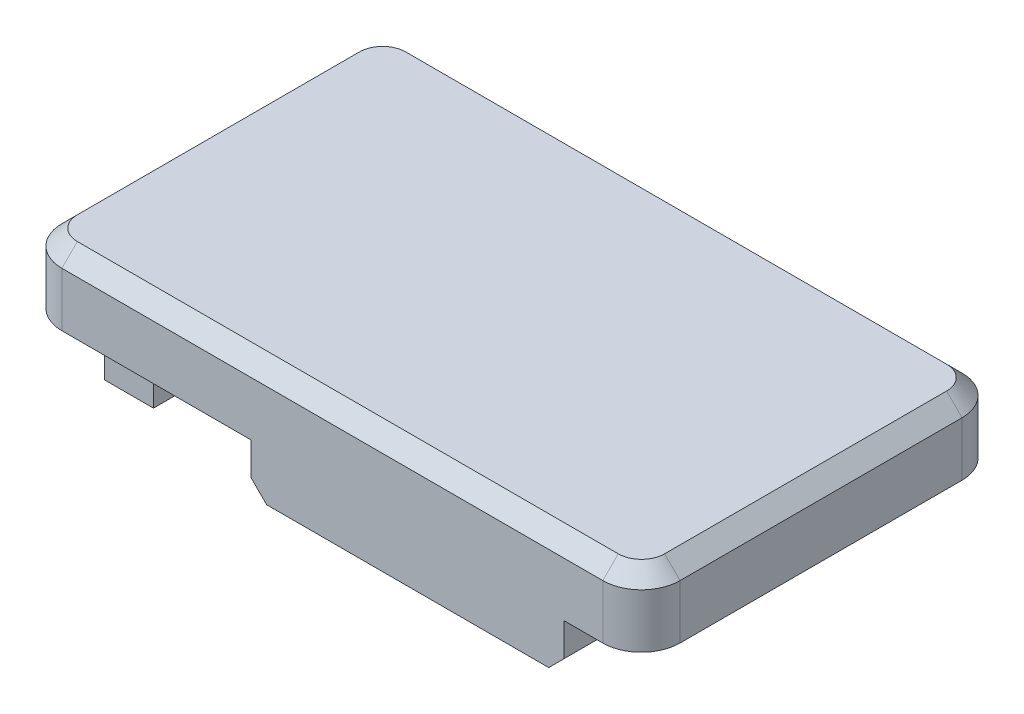
ISO-10303-21;
HEADER;
FILE_DESCRIPTION(('STEP AP214'),'2;1');
FILE_NAME('part.step','',(''),(''),'','','');
FILE_SCHEMA(('AUTOMOTIVE_DESIGN { 1 0 10303 214 1 1 1 1 }'));
ENDSEC;
DATA;
#1=APPLICATION_CONTEXT('core data for automotive mechanical design processes');
#2=APPLICATION_PROTOCOL_DEFINITION('international standard','automotive_design',2000,#1);
#3=PRODUCT_CONTEXT('',#1,'mechanical');
#4=PRODUCT('Part','Part','',(#3));
#5=PRODUCT_RELATED_PRODUCT_CATEGORY('part','',(#4));
#6=PRODUCT_DEFINITION_FORMATION('','',#4);
#7=PRODUCT_DEFINITION_CONTEXT('part definition',#1,'design');
#8=PRODUCT_DEFINITION('design','',#6,#7);
#9=PRODUCT_DEFINITION_SHAPE('','',#8);
#10=(LENGTH_UNIT() NAMED_UNIT(*) SI_UNIT(.MILLI.,.METRE.));
#11=(NAMED_UNIT(*) PLANE_ANGLE_UNIT() SI_UNIT($,.RADIAN.));
#12=(NAMED_UNIT(*) SI_UNIT($,.STERADIAN.) SOLID_ANGLE_UNIT());
#13=UNCERTAINTY_MEASURE_WITH_UNIT(LENGTH_MEASURE(1.E-05),#10,'distance_accuracy_value','');
#14=(GEOMETRIC_REPRESENTATION_CONTEXT(3) GLOBAL_UNCERTAINTY_ASSIGNED_CONTEXT((#13)) GLOBAL_UNIT_ASSIGNED_CONTEXT((#10,
#11,#12)) REPRESENTATION_CONTEXT('',''));
#15=CARTESIAN_POINT('',(0.,0.,0.));
#16=DIRECTION('',(0.,0.,1.));
#17=DIRECTION('',(1.,0.,0.));
#18=AXIS2_PLACEMENT_3D('',#15,#16,#17);
#19=CARTESIAN_POINT('',(0.,0.,0.));
#20=DIRECTION('',(0.,1.,0.));
#21=DIRECTION('',(0.,0.,1.));
#22=AXIS2_PLACEMENT_3D('',#19,#20,#21);
#23=PLANE('',#22);
#24=DIRECTION('',(-1.,0.,0.));
#25=VECTOR('',#24,1.);
#26=CARTESIAN_POINT('',(66.8395192480296,0.,-2.2));
#27=LINE('',#26,#25);
#28=CARTESIAN_POINT('',(66.8395192480296,0.,-2.2));
#29=VERTEX_POINT('',#28);
#30=CARTESIAN_POINT('',(64.2995192480296,0.,-2.2));
#31=VERTEX_POINT('',#30);
#32=EDGE_CURVE('E252',#29,#31,#27,.T.);
#33=ORIENTED_EDGE('',*,*,#32,.F.);
#34=DIRECTION('',(0.,0.,1.));
#35=VECTOR('',#34,1.);
#36=CARTESIAN_POINT('',(66.8395192480296,0.,-12.36));
#37=LINE('',#36,#35);
#38=CARTESIAN_POINT('',(66.8395192480296,0.,-12.36));
#39=VERTEX_POINT('',#38);
#40=EDGE_CURVE('E317',#39,#29,#37,.T.);
#41=ORIENTED_EDGE('',*,*,#40,.F.);
#42=DIRECTION('',(1.,0.,0.));
#43=VECTOR('',#42,1.);
#44=CARTESIAN_POINT('',(64.2995192480296,0.,-12.36));
#45=LINE('',#44,#43);
#46=CARTESIAN_POINT('',(64.2995192480296,0.,-12.36));
#47=VERTEX_POINT('',#46);
#48=EDGE_CURVE('E334',#47,#39,#45,.T.);
#49=ORIENTED_EDGE('',*,*,#48,.F.);
#50=DIRECTION('',(0.,0.,-1.));
#51=VECTOR('',#50,1.);
#52=CARTESIAN_POINT('',(64.2995192480296,0.,-2.2));
#53=LINE('',#52,#51);
#54=EDGE_CURVE('E330',#31,#47,#53,.T.);
#55=ORIENTED_EDGE('',*,*,#54,.F.);
#56=EDGE_LOOP('',(#33,#41,#49,#55));
#57=FACE_BOUND('',#56,.T.);
#58=DIRECTION('',(0.,0.,1.));
#59=VECTOR('',#58,1.);
#60=CARTESIAN_POINT('',(62.2995192480296,0.,-18.6));
#61=LINE('',#60,#59);
#62=CARTESIAN_POINT('',(62.2995192480296,0.,-16.6));
#63=VERTEX_POINT('',#62);
#64=CARTESIAN_POINT('',(62.2995192480296,0.,-2.));
#65=VERTEX_POINT('',#64);
#66=EDGE_CURVE('E356',#63,#65,#61,.T.);
#67=ORIENTED_EDGE('',*,*,#66,.F.);
#68=CARTESIAN_POINT('',(64.2995192480296,0.,-16.6));
#69=DIRECTION('',(0.,1.,0.));
#70=DIRECTION('',(0.,0.,1.));
#71=AXIS2_PLACEMENT_3D('',#68,#69,#70);
#72=CIRCLE('',#71,2.);
#73=CARTESIAN_POINT('',(64.2995192480296,0.,-18.6));
#74=VERTEX_POINT('',#73);
#75=EDGE_CURVE('E389',#63,#74,#72,.F.);
#76=ORIENTED_EDGE('',*,*,#75,.T.);
#77=DIRECTION('',(-1.,0.,0.));
#78=VECTOR('',#77,1.);
#79=CARTESIAN_POINT('',(94.2995192480296,0.,-18.6));
#80=LINE('',#79,#78);
#81=CARTESIAN_POINT('',(74.0995192480296,0.,-18.6));
#82=VERTEX_POINT('',#81);
#83=EDGE_CURVE('E369',#82,#74,#80,.T.);
#84=ORIENTED_EDGE('',*,*,#83,.F.);
#85=DIRECTION('',(0.,0.,-1.));
#86=VECTOR('',#85,1.);
#87=CARTESIAN_POINT('',(74.0995192480296,0.,-18.6));
#88=LINE('',#87,#86);
#89=CARTESIAN_POINT('',(74.0995192480296,0.,-16.6));
#90=VERTEX_POINT('',#89);
#91=EDGE_CURVE('E269',#90,#82,#88,.T.);
#92=ORIENTED_EDGE('',*,*,#91,.F.);
#93=DIRECTION('',(-1.,0.,0.));
#94=VECTOR('',#93,1.);
#95=CARTESIAN_POINT('',(74.0995192480296,0.,-16.6));
#96=LINE('',#95,#94);
#97=CARTESIAN_POINT('',(90.2995192480296,0.,-16.6));
#98=VERTEX_POINT('',#97);
#99=EDGE_CURVE('E245',#98,#90,#96,.T.);
#100=ORIENTED_EDGE('',*,*,#99,.F.);
#101=DIRECTION('',(0.,0.,1.));
#102=VECTOR('',#101,1.);
#103=CARTESIAN_POINT('',(90.2995192480296,0.,-16.6));
#104=LINE('',#103,#102);
#105=CARTESIAN_POINT('',(90.2995192480296,0.,-18.6));
#106=VERTEX_POINT('',#105);
#107=EDGE_CURVE('E256',#106,#98,#104,.T.);
#108=ORIENTED_EDGE('',*,*,#107,.F.);
#109=CARTESIAN_POINT('',(92.2995192480296,0.,-18.6));
#110=VERTEX_POINT('',#109);
#111=EDGE_CURVE('E370',#110,#106,#80,.T.);
#112=ORIENTED_EDGE('',*,*,#111,.F.);
#113=CARTESIAN_POINT('',(92.2995192480296,0.,-16.6));
#114=DIRECTION('',(0.,1.,0.));
#115=DIRECTION('',(0.,0.,1.));
#116=AXIS2_PLACEMENT_3D('',#113,#114,#115);
#117=CIRCLE('',#116,2.);
#118=CARTESIAN_POINT('',(94.2995192480296,0.,-16.6));
#119=VERTEX_POINT('',#118);
#120=EDGE_CURVE('E386',#110,#119,#117,.F.);
#121=ORIENTED_EDGE('',*,*,#120,.T.);
#122=DIRECTION('',(0.,0.,-1.));
#123=VECTOR('',#122,1.);
#124=CARTESIAN_POINT('',(94.2995192480296,0.,0.));
#125=LINE('',#124,#123);
#126=CARTESIAN_POINT('',(94.2995192480296,0.,-2.));
#127=VERTEX_POINT('',#126);
#128=EDGE_CURVE('E365',#127,#119,#125,.T.);
#129=ORIENTED_EDGE('',*,*,#128,.F.);
#130=CARTESIAN_POINT('',(92.2995192480296,0.,-2.));
#131=DIRECTION('',(0.,1.,0.));
#132=DIRECTION('',(0.,0.,1.));
#133=AXIS2_PLACEMENT_3D('',#130,#131,#132);
#134=CIRCLE('',#133,2.);
#135=CARTESIAN_POINT('',(92.2995192480296,0.,0.));
#136=VERTEX_POINT('',#135);
#137=EDGE_CURVE('E383',#127,#136,#134,.F.);
#138=ORIENTED_EDGE('',*,*,#137,.T.);
#139=DIRECTION('',(1.,0.,0.));
#140=VECTOR('',#139,1.);
#141=CARTESIAN_POINT('',(62.2995192480296,0.,0.));
#142=LINE('',#141,#140);
#143=CARTESIAN_POINT('',(90.2995192480296,0.,0.));
#144=VERTEX_POINT('',#143);
#145=EDGE_CURVE('E360',#144,#136,#142,.T.);
#146=ORIENTED_EDGE('',*,*,#145,.F.);
#147=DIRECTION('',(0.,0.,1.));
#148=VECTOR('',#147,1.);
#149=CARTESIAN_POINT('',(90.2995192480296,0.,-2.));
#150=LINE('',#149,#148);
#151=CARTESIAN_POINT('',(90.2995192480296,0.,-2.));
#152=VERTEX_POINT('',#151);
#153=EDGE_CURVE('E302',#152,#144,#150,.T.);
#154=ORIENTED_EDGE('',*,*,#153,.F.);
#155=DIRECTION('',(1.,0.,0.));
#156=VECTOR('',#155,1.);
#157=CARTESIAN_POINT('',(74.0995192480296,0.,-2.));
#158=LINE('',#157,#156);
#159=CARTESIAN_POINT('',(74.0995192480296,0.,-2.));
#160=VERTEX_POINT('',#159);
#161=EDGE_CURVE('E264',#160,#152,#158,.T.);
#162=ORIENTED_EDGE('',*,*,#161,.F.);
#163=DIRECTION('',(0.,0.,-1.));
#164=VECTOR('',#163,1.);
#165=CARTESIAN_POINT('',(74.0995192480296,0.,0.));
#166=LINE('',#165,#164);
#167=CARTESIAN_POINT('',(74.0995192480296,0.,0.));
#168=VERTEX_POINT('',#167);
#169=EDGE_CURVE('E298',#168,#160,#166,.T.);
#170=ORIENTED_EDGE('',*,*,#169,.F.);
#171=CARTESIAN_POINT('',(64.2995192480296,0.,0.));
#172=VERTEX_POINT('',#171);
#173=EDGE_CURVE('E361',#172,#168,#142,.T.);
#174=ORIENTED_EDGE('',*,*,#173,.F.);
#175=CARTESIAN_POINT('',(64.2995192480296,0.,-2.));
#176=DIRECTION('',(0.,1.,0.));
#177=DIRECTION('',(0.,0.,1.));
#178=AXIS2_PLACEMENT_3D('',#175,#176,#177);
#179=CIRCLE('',#178,2.);
#180=EDGE_CURVE('E380',#172,#65,#179,.F.);
#181=ORIENTED_EDGE('',*,*,#180,.T.);
#182=EDGE_LOOP('',(#67,#76,#84,#92,#100,#108,#112,#121,#129,#138,#146,#154,#162,#170,#174,#181));
#183=FACE_BOUND('',#182,.T.);
#184=ADVANCED_FACE('F52',(#57,#183),#23,.F.);
#185=CARTESIAN_POINT('',(62.2995192480296,3.6,-18.6));
#186=DIRECTION('',(1.,0.,0.));
#187=DIRECTION('',(0.,0.,-1.));
#188=AXIS2_PLACEMENT_3D('',#185,#186,#187);
#189=PLANE('',#188);
#190=DIRECTION('',(0.,-1.,0.));
#191=VECTOR('',#190,1.);
#192=CARTESIAN_POINT('',(62.2995192480296,3.6,-2.));
#193=LINE('',#192,#191);
#194=CARTESIAN_POINT('',(62.2995192480296,2.8,-2.));
#195=VERTEX_POINT('',#194);
#196=EDGE_CURVE('E373',#65,#195,#193,.F.);
#197=ORIENTED_EDGE('',*,*,#196,.T.);
#198=DIRECTION('',(0.,0.,-1.));
#199=VECTOR('',#198,1.);
#200=CARTESIAN_POINT('',(62.2995192480296,2.8,-16.6));
#201=LINE('',#200,#199);
#202=CARTESIAN_POINT('',(62.2995192480296,2.8,-16.6));
#203=VERTEX_POINT('',#202);
#204=EDGE_CURVE('E454',#195,#203,#201,.T.);
#205=ORIENTED_EDGE('',*,*,#204,.T.);
#206=DIRECTION('',(0.,-1.,0.));
#207=VECTOR('',#206,1.);
#208=CARTESIAN_POINT('',(62.2995192480296,3.6,-16.6));
#209=LINE('',#208,#207);
#210=EDGE_CURVE('E377',#203,#63,#209,.T.);
#211=ORIENTED_EDGE('',*,*,#210,.T.);
#212=ORIENTED_EDGE('',*,*,#66,.T.);
#213=EDGE_LOOP('',(#197,#205,#211,#212));
#214=FACE_BOUND('',#213,.T.);
#215=ADVANCED_FACE('F666',(#214),#189,.F.);
#216=CARTESIAN_POINT('',(62.2995192480296,3.6,0.));
#217=DIRECTION('',(0.,0.,-1.));
#218=DIRECTION('',(-1.,0.,0.));
#219=AXIS2_PLACEMENT_3D('',#216,#217,#218);
#220=PLANE('',#219);
#221=DIRECTION('',(0.,1.,0.));
#222=VECTOR('',#221,1.);
#223=CARTESIAN_POINT('',(74.0995192480296,-2.5,0.));
#224=LINE('',#223,#222);
#225=CARTESIAN_POINT('',(74.0995192480296,-1.69999999999999,0.));
#226=VERTEX_POINT('',#225);
#227=EDGE_CURVE('E291',#226,#168,#224,.T.);
#228=ORIENTED_EDGE('',*,*,#227,.F.);
#229=DIRECTION('',(0.707106781186548,-0.707106781186548,0.));
#230=VECTOR('',#229,1.);
#231=CARTESIAN_POINT('',(74.8995192480296,-2.5,0.));
#232=LINE('',#231,#230);
#233=CARTESIAN_POINT('',(74.8995192480296,-2.5,0.));
#234=VERTEX_POINT('',#233);
#235=EDGE_CURVE('E532',#226,#234,#232,.T.);
#236=ORIENTED_EDGE('',*,*,#235,.T.);
#237=DIRECTION('',(-1.,0.,0.));
#238=VECTOR('',#237,1.);
#239=CARTESIAN_POINT('',(90.2995192480296,-2.5,0.));
#240=LINE('',#239,#238);
#241=CARTESIAN_POINT('',(89.4995192480296,-2.5,0.));
#242=VERTEX_POINT('',#241);
#243=EDGE_CURVE('E297',#242,#234,#240,.T.);
#244=ORIENTED_EDGE('',*,*,#243,.F.);
#245=DIRECTION('',(0.707106781186548,0.707106781186548,0.));
#246=VECTOR('',#245,1.);
#247=CARTESIAN_POINT('',(89.4995192480296,-2.5,0.));
#248=LINE('',#247,#246);
#249=CARTESIAN_POINT('',(90.2995192480296,-1.69999999999999,0.));
#250=VERTEX_POINT('',#249);
#251=EDGE_CURVE('E78',#242,#250,#248,.T.);
#252=ORIENTED_EDGE('',*,*,#251,.T.);
#253=DIRECTION('',(0.,1.,0.));
#254=VECTOR('',#253,1.);
#255=CARTESIAN_POINT('',(90.2995192480296,-2.5,0.));
#256=LINE('',#255,#254);
#257=EDGE_CURVE('E287',#250,#144,#256,.T.);
#258=ORIENTED_EDGE('',*,*,#257,.T.);
#259=ORIENTED_EDGE('',*,*,#145,.T.);
#260=DIRECTION('',(0.,-1.,0.));
#261=VECTOR('',#260,1.);
#262=CARTESIAN_POINT('',(92.2995192480296,3.6,0.));
#263=LINE('',#262,#261);
#264=CARTESIAN_POINT('',(92.2995192480296,2.8,0.));
#265=VERTEX_POINT('',#264);
#266=EDGE_CURVE('E409',#136,#265,#263,.F.);
#267=ORIENTED_EDGE('',*,*,#266,.T.);
#268=DIRECTION('',(-1.,0.,0.));
#269=VECTOR('',#268,1.);
#270=CARTESIAN_POINT('',(64.2995192480296,2.8,0.));
#271=LINE('',#270,#269);
#272=CARTESIAN_POINT('',(64.2995192480296,2.8,0.));
#273=VERTEX_POINT('',#272);
#274=EDGE_CURVE('E448',#265,#273,#271,.T.);
#275=ORIENTED_EDGE('',*,*,#274,.T.);
#276=DIRECTION('',(0.,-1.,0.));
#277=VECTOR('',#276,1.);
#278=CARTESIAN_POINT('',(64.2995192480296,3.6,0.));
#279=LINE('',#278,#277);
#280=EDGE_CURVE('E406',#273,#172,#279,.T.);
#281=ORIENTED_EDGE('',*,*,#280,.T.);
#282=ORIENTED_EDGE('',*,*,#173,.T.);
#283=EDGE_LOOP('',(#228,#236,#244,#252,#258,#259,#267,#275,#281,#282));
#284=FACE_BOUND('',#283,.T.);
#285=ADVANCED_FACE('F561',(#284),#220,.F.);
#286=CARTESIAN_POINT('',(94.2995192480296,3.6,0.));
#287=DIRECTION('',(-1.,0.,0.));
#288=DIRECTION('',(0.,0.,1.));
#289=AXIS2_PLACEMENT_3D('',#286,#287,#288);
#290=PLANE('',#289);
#291=DIRECTION('',(0.,-1.,0.));
#292=VECTOR('',#291,1.);
#293=CARTESIAN_POINT('',(94.2995192480296,3.6,-16.6));
#294=LINE('',#293,#292);
#295=CARTESIAN_POINT('',(94.2995192480296,2.8,-16.6));
#296=VERTEX_POINT('',#295);
#297=EDGE_CURVE('E402',#119,#296,#294,.F.);
#298=ORIENTED_EDGE('',*,*,#297,.T.);
#299=DIRECTION('',(0.,0.,1.));
#300=VECTOR('',#299,1.);
#301=CARTESIAN_POINT('',(94.2995192480296,2.8,-2.));
#302=LINE('',#301,#300);
#303=CARTESIAN_POINT('',(94.2995192480296,2.8,-2.));
#304=VERTEX_POINT('',#303);
#305=EDGE_CURVE('E442',#296,#304,#302,.T.);
#306=ORIENTED_EDGE('',*,*,#305,.T.);
#307=DIRECTION('',(0.,-1.,0.));
#308=VECTOR('',#307,1.);
#309=CARTESIAN_POINT('',(94.2995192480296,3.6,-2.));
#310=LINE('',#309,#308);
#311=EDGE_CURVE('E399',#304,#127,#310,.T.);
#312=ORIENTED_EDGE('',*,*,#311,.T.);
#313=ORIENTED_EDGE('',*,*,#128,.T.);
#314=EDGE_LOOP('',(#298,#306,#312,#313));
#315=FACE_BOUND('',#314,.T.);
#316=ADVANCED_FACE('F637',(#315),#290,.F.);
#317=CARTESIAN_POINT('',(94.2995192480296,3.6,-18.6));
#318=DIRECTION('',(0.,0.,1.));
#319=DIRECTION('',(1.,0.,0.));
#320=AXIS2_PLACEMENT_3D('',#317,#318,#319);
#321=PLANE('',#320);
#322=DIRECTION('',(1.,0.,0.));
#323=VECTOR('',#322,1.);
#324=CARTESIAN_POINT('',(90.2995192480296,-2.5,-18.6));
#325=LINE('',#324,#323);
#326=CARTESIAN_POINT('',(74.8995192480296,-2.5,-18.6));
#327=VERTEX_POINT('',#326);
#328=CARTESIAN_POINT('',(89.4995192480296,-2.5,-18.6));
#329=VERTEX_POINT('',#328);
#330=EDGE_CURVE('E273',#327,#329,#325,.T.);
#331=ORIENTED_EDGE('',*,*,#330,.F.);
#332=DIRECTION('',(0.707106781186544,-0.707106781186551,0.));
#333=VECTOR('',#332,1.);
#334=CARTESIAN_POINT('',(74.8995192480296,-2.5,-18.6));
#335=LINE('',#334,#333);
#336=CARTESIAN_POINT('',(74.0995192480296,-1.7,-18.6));
#337=VERTEX_POINT('',#336);
#338=EDGE_CURVE('E506',#327,#337,#335,.F.);
#339=ORIENTED_EDGE('',*,*,#338,.T.);
#340=DIRECTION('',(0.,1.,0.));
#341=VECTOR('',#340,1.);
#342=CARTESIAN_POINT('',(74.0995192480296,-2.5,-18.6));
#343=LINE('',#342,#341);
#344=EDGE_CURVE('E279',#337,#82,#343,.T.);
#345=ORIENTED_EDGE('',*,*,#344,.T.);
#346=ORIENTED_EDGE('',*,*,#83,.T.);
#347=DIRECTION('',(0.,-1.,0.));
#348=VECTOR('',#347,1.);
#349=CARTESIAN_POINT('',(64.2995192480296,3.6,-18.6));
#350=LINE('',#349,#348);
#351=CARTESIAN_POINT('',(64.2995192480296,2.8,-18.6));
#352=VERTEX_POINT('',#351);
#353=EDGE_CURVE('E395',#74,#352,#350,.F.);
#354=ORIENTED_EDGE('',*,*,#353,.T.);
#355=DIRECTION('',(1.,0.,0.));
#356=VECTOR('',#355,1.);
#357=CARTESIAN_POINT('',(92.2995192480296,2.8,-18.6));
#358=LINE('',#357,#356);
#359=CARTESIAN_POINT('',(92.2995192480296,2.8,-18.6));
#360=VERTEX_POINT('',#359);
#361=EDGE_CURVE('E460',#352,#360,#358,.T.);
#362=ORIENTED_EDGE('',*,*,#361,.T.);
#363=DIRECTION('',(0.,-1.,0.));
#364=VECTOR('',#363,1.);
#365=CARTESIAN_POINT('',(92.2995192480296,3.6,-18.6));
#366=LINE('',#365,#364);
#367=EDGE_CURVE('E392',#360,#110,#366,.T.);
#368=ORIENTED_EDGE('',*,*,#367,.T.);
#369=ORIENTED_EDGE('',*,*,#111,.T.);
#370=DIRECTION('',(0.,1.,0.));
#371=VECTOR('',#370,1.);
#372=CARTESIAN_POINT('',(90.2995192480296,-2.5,-18.6));
#373=LINE('',#372,#371);
#374=CARTESIAN_POINT('',(90.2995192480296,-1.7,-18.6));
#375=VERTEX_POINT('',#374);
#376=EDGE_CURVE('E259',#375,#106,#373,.T.);
#377=ORIENTED_EDGE('',*,*,#376,.F.);
#378=DIRECTION('',(0.707106781186544,0.707106781186551,0.));
#379=VECTOR('',#378,1.);
#380=CARTESIAN_POINT('',(89.4995192480296,-2.5,-18.6));
#381=LINE('',#380,#379);
#382=EDGE_CURVE('E503',#375,#329,#381,.F.);
#383=ORIENTED_EDGE('',*,*,#382,.T.);
#384=EDGE_LOOP('',(#331,#339,#345,#346,#354,#362,#368,#369,#377,#383));
#385=FACE_BOUND('',#384,.T.);
#386=ADVANCED_FACE('F599',(#385),#321,.F.);
#387=CARTESIAN_POINT('',(0.,3.6,0.));
#388=DIRECTION('',(0.,1.,0.));
#389=DIRECTION('',(0.,0.,1.));
#390=AXIS2_PLACEMENT_3D('',#387,#388,#389);
#391=PLANE('',#390);
#392=DIRECTION('',(0.,0.,-1.));
#393=VECTOR('',#392,1.);
#394=CARTESIAN_POINT('',(93.4995192480296,3.6,-16.6));
#395=LINE('',#394,#393);
#396=CARTESIAN_POINT('',(93.4995192480296,3.6,-2.));
#397=VERTEX_POINT('',#396);
#398=CARTESIAN_POINT('',(93.4995192480296,3.6,-16.6));
#399=VERTEX_POINT('',#398);
#400=EDGE_CURVE('E431',#397,#399,#395,.T.);
#401=ORIENTED_EDGE('',*,*,#400,.T.);
#402=CARTESIAN_POINT('',(92.2995192480296,3.6,-16.6));
#403=DIRECTION('',(0.,1.,0.));
#404=DIRECTION('',(0.,0.,1.));
#405=AXIS2_PLACEMENT_3D('',#402,#403,#404);
#406=CIRCLE('',#405,1.20000000000001);
#407=CARTESIAN_POINT('',(92.2995192480296,3.6,-17.8));
#408=VERTEX_POINT('',#407);
#409=EDGE_CURVE('E434',#399,#408,#406,.T.);
#410=ORIENTED_EDGE('',*,*,#409,.T.);
#411=DIRECTION('',(-1.,0.,0.));
#412=VECTOR('',#411,1.);
#413=CARTESIAN_POINT('',(64.2995192480296,3.6,-17.8));
#414=LINE('',#413,#412);
#415=CARTESIAN_POINT('',(64.2995192480296,3.6,-17.8));
#416=VERTEX_POINT('',#415);
#417=EDGE_CURVE('E413',#408,#416,#414,.T.);
#418=ORIENTED_EDGE('',*,*,#417,.T.);
#419=CARTESIAN_POINT('',(64.2995192480296,3.6,-16.6));
#420=DIRECTION('',(0.,1.,0.));
#421=DIRECTION('',(0.,0.,1.));
#422=AXIS2_PLACEMENT_3D('',#419,#420,#421);
#423=CIRCLE('',#422,1.20000000000001);
#424=CARTESIAN_POINT('',(63.0995192480296,3.6,-16.6));
#425=VERTEX_POINT('',#424);
#426=EDGE_CURVE('E416',#416,#425,#423,.T.);
#427=ORIENTED_EDGE('',*,*,#426,.T.);
#428=DIRECTION('',(0.,0.,1.));
#429=VECTOR('',#428,1.);
#430=CARTESIAN_POINT('',(63.0995192480296,3.6,-2.));
#431=LINE('',#430,#429);
#432=CARTESIAN_POINT('',(63.0995192480296,3.6,-2.));
#433=VERTEX_POINT('',#432);
#434=EDGE_CURVE('E419',#425,#433,#431,.T.);
#435=ORIENTED_EDGE('',*,*,#434,.T.);
#436=CARTESIAN_POINT('',(64.2995192480296,3.6,-2.));
#437=DIRECTION('',(0.,1.,0.));
#438=DIRECTION('',(0.,0.,1.));
#439=AXIS2_PLACEMENT_3D('',#436,#437,#438);
#440=CIRCLE('',#439,1.20000000000001);
#441=CARTESIAN_POINT('',(64.2995192480296,3.6,-0.799999999999993));
#442=VERTEX_POINT('',#441);
#443=EDGE_CURVE('E422',#433,#442,#440,.T.);
#444=ORIENTED_EDGE('',*,*,#443,.T.);
#445=DIRECTION('',(1.,0.,0.));
#446=VECTOR('',#445,1.);
#447=CARTESIAN_POINT('',(92.2995192480296,3.6,-0.799999999999995));
#448=LINE('',#447,#446);
#449=CARTESIAN_POINT('',(92.2995192480296,3.6,-0.799999999999995));
#450=VERTEX_POINT('',#449);
#451=EDGE_CURVE('E425',#442,#450,#448,.T.);
#452=ORIENTED_EDGE('',*,*,#451,.T.);
#453=CARTESIAN_POINT('',(92.2995192480296,3.6,-2.));
#454=DIRECTION('',(0.,1.,0.));
#455=DIRECTION('',(0.,0.,1.));
#456=AXIS2_PLACEMENT_3D('',#453,#454,#455);
#457=CIRCLE('',#456,1.20000000000001);
#458=EDGE_CURVE('E428',#450,#397,#457,.T.);
#459=ORIENTED_EDGE('',*,*,#458,.T.);
#460=EDGE_LOOP('',(#401,#410,#418,#427,#435,#444,#452,#459));
#461=FACE_BOUND('',#460,.T.);
#462=ADVANCED_FACE('F836',(#461),#391,.T.);
#463=CARTESIAN_POINT('',(66.8395192480296,-3.3,-2.2));
#464=DIRECTION('',(0.,0.,-1.));
#465=DIRECTION('',(-1.,0.,0.));
#466=AXIS2_PLACEMENT_3D('',#463,#464,#465);
#467=PLANE('',#466);
#468=ORIENTED_EDGE('',*,*,#32,.T.);
#469=DIRECTION('',(0.,1.,0.));
#470=VECTOR('',#469,1.);
#471=CARTESIAN_POINT('',(64.2995192480296,-3.3,-2.2));
#472=LINE('',#471,#470);
#473=CARTESIAN_POINT('',(64.2995192480296,-3.3,-2.2));
#474=VERTEX_POINT('',#473);
#475=EDGE_CURVE('E352',#474,#31,#472,.T.);
#476=ORIENTED_EDGE('',*,*,#475,.F.);
#477=DIRECTION('',(-1.,0.,0.));
#478=VECTOR('',#477,1.);
#479=CARTESIAN_POINT('',(66.8395192480296,-3.3,-2.2));
#480=LINE('',#479,#478);
#481=CARTESIAN_POINT('',(66.8395192480296,-3.3,-2.2));
#482=VERTEX_POINT('',#481);
#483=EDGE_CURVE('E312',#482,#474,#480,.T.);
#484=ORIENTED_EDGE('',*,*,#483,.F.);
#485=DIRECTION('',(0.,1.,0.));
#486=VECTOR('',#485,1.);
#487=CARTESIAN_POINT('',(66.8395192480296,-3.3,-2.2));
#488=LINE('',#487,#486);
#489=EDGE_CURVE('E326',#482,#29,#488,.T.);
#490=ORIENTED_EDGE('',*,*,#489,.T.);
#491=EDGE_LOOP('',(#468,#476,#484,#490));
#492=FACE_BOUND('',#491,.T.);
#493=ADVANCED_FACE('F909',(#492),#467,.F.);
#494=CARTESIAN_POINT('',(64.2995192480296,-3.3,-2.2));
#495=DIRECTION('',(1.,0.,0.));
#496=DIRECTION('',(0.,0.,-1.));
#497=AXIS2_PLACEMENT_3D('',#494,#495,#496);
#498=PLANE('',#497);
#499=ORIENTED_EDGE('',*,*,#54,.T.);
#500=DIRECTION('',(0.,1.,0.));
#501=VECTOR('',#500,1.);
#502=CARTESIAN_POINT('',(64.2995192480296,-3.3,-12.36));
#503=LINE('',#502,#501);
#504=CARTESIAN_POINT('',(64.2995192480296,-3.3,-12.36));
#505=VERTEX_POINT('',#504);
#506=EDGE_CURVE('E348',#505,#47,#503,.T.);
#507=ORIENTED_EDGE('',*,*,#506,.F.);
#508=DIRECTION('',(0.,0.,-1.));
#509=VECTOR('',#508,1.);
#510=CARTESIAN_POINT('',(64.2995192480296,-3.3,-2.2));
#511=LINE('',#510,#509);
#512=EDGE_CURVE('E316',#474,#505,#511,.T.);
#513=ORIENTED_EDGE('',*,*,#512,.F.);
#514=ORIENTED_EDGE('',*,*,#475,.T.);
#515=EDGE_LOOP('',(#499,#507,#513,#514));
#516=FACE_BOUND('',#515,.T.);
#517=ADVANCED_FACE('F936',(#516),#498,.F.);
#518=CARTESIAN_POINT('',(64.2995192480296,-3.3,-12.36));
#519=DIRECTION('',(0.,0.,1.));
#520=DIRECTION('',(1.,0.,0.));
#521=AXIS2_PLACEMENT_3D('',#518,#519,#520);
#522=PLANE('',#521);
#523=ORIENTED_EDGE('',*,*,#48,.T.);
#524=DIRECTION('',(0.,1.,0.));
#525=VECTOR('',#524,1.);
#526=CARTESIAN_POINT('',(66.8395192480296,-3.3,-12.36));
#527=LINE('',#526,#525);
#528=CARTESIAN_POINT('',(66.8395192480296,-3.3,-12.36));
#529=VERTEX_POINT('',#528);
#530=EDGE_CURVE('E344',#529,#39,#527,.T.);
#531=ORIENTED_EDGE('',*,*,#530,.F.);
#532=DIRECTION('',(1.,0.,0.));
#533=VECTOR('',#532,1.);
#534=CARTESIAN_POINT('',(64.2995192480296,-3.3,-12.36));
#535=LINE('',#534,#533);
#536=EDGE_CURVE('E320',#505,#529,#535,.T.);
#537=ORIENTED_EDGE('',*,*,#536,.F.);
#538=ORIENTED_EDGE('',*,*,#506,.T.);
#539=EDGE_LOOP('',(#523,#531,#537,#538));
#540=FACE_BOUND('',#539,.T.);
#541=ADVANCED_FACE('F946',(#540),#522,.F.);
#542=CARTESIAN_POINT('',(66.8395192480296,-3.3,-12.36));
#543=DIRECTION('',(-1.,0.,0.));
#544=DIRECTION('',(0.,0.,1.));
#545=AXIS2_PLACEMENT_3D('',#542,#543,#544);
#546=PLANE('',#545);
#547=ORIENTED_EDGE('',*,*,#40,.T.);
#548=ORIENTED_EDGE('',*,*,#489,.F.);
#549=DIRECTION('',(0.,0.,1.));
#550=VECTOR('',#549,1.);
#551=CARTESIAN_POINT('',(66.8395192480296,-3.3,-12.36));
#552=LINE('',#551,#550);
#553=EDGE_CURVE('E323',#529,#482,#552,.T.);
#554=ORIENTED_EDGE('',*,*,#553,.F.);
#555=ORIENTED_EDGE('',*,*,#530,.T.);
#556=EDGE_LOOP('',(#547,#548,#554,#555));
#557=FACE_BOUND('',#556,.T.);
#558=ADVANCED_FACE('F956',(#557),#546,.F.);
#559=CARTESIAN_POINT('',(0.,-3.3,0.));
#560=DIRECTION('',(0.,-1.,0.));
#561=DIRECTION('',(0.,0.,-1.));
#562=AXIS2_PLACEMENT_3D('',#559,#560,#561);
#563=PLANE('',#562);
#564=ORIENTED_EDGE('',*,*,#483,.T.);
#565=ORIENTED_EDGE('',*,*,#512,.T.);
#566=ORIENTED_EDGE('',*,*,#536,.T.);
#567=ORIENTED_EDGE('',*,*,#553,.T.);
#568=EDGE_LOOP('',(#564,#565,#566,#567));
#569=FACE_BOUND('',#568,.T.);
#570=ADVANCED_FACE('F829',(#569),#563,.T.);
#571=CARTESIAN_POINT('',(90.2995192480296,-2.5,-16.6));
#572=DIRECTION('',(-1.,0.,0.));
#573=DIRECTION('',(0.,0.,1.));
#574=AXIS2_PLACEMENT_3D('',#571,#572,#573);
#575=PLANE('',#574);
#576=DIRECTION('',(0.,1.,0.));
#577=VECTOR('',#576,1.);
#578=CARTESIAN_POINT('',(90.2995192480296,-2.5,-16.6));
#579=LINE('',#578,#577);
#580=CARTESIAN_POINT('',(90.2995192480296,-1.7,-16.6));
#581=VERTEX_POINT('',#580);
#582=EDGE_CURVE('E240',#581,#98,#579,.T.);
#583=ORIENTED_EDGE('',*,*,#582,.F.);
#584=DIRECTION('',(0.,0.,-1.));
#585=VECTOR('',#584,1.);
#586=CARTESIAN_POINT('',(90.2995192480296,-1.7,-16.6));
#587=LINE('',#586,#585);
#588=EDGE_CURVE('E512',#581,#375,#587,.T.);
#589=ORIENTED_EDGE('',*,*,#588,.T.);
#590=ORIENTED_EDGE('',*,*,#376,.T.);
#591=ORIENTED_EDGE('',*,*,#107,.T.);
#592=EDGE_LOOP('',(#583,#589,#590,#591));
#593=FACE_BOUND('',#592,.T.);
#594=ADVANCED_FACE('F257',(#593),#575,.F.);
#595=CARTESIAN_POINT('',(74.0995192480296,-2.5,-16.6));
#596=DIRECTION('',(0.,0.,-1.));
#597=DIRECTION('',(-1.,0.,0.));
#598=AXIS2_PLACEMENT_3D('',#595,#596,#597);
#599=PLANE('',#598);
#600=DIRECTION('',(0.,1.,0.));
#601=VECTOR('',#600,1.);
#602=CARTESIAN_POINT('',(74.0995192480296,-2.5,-16.6));
#603=LINE('',#602,#601);
#604=CARTESIAN_POINT('',(74.0995192480296,-1.7,-16.6));
#605=VERTEX_POINT('',#604);
#606=EDGE_CURVE('E253',#605,#90,#603,.T.);
#607=ORIENTED_EDGE('',*,*,#606,.F.);
#608=DIRECTION('',(1.,0.,0.));
#609=VECTOR('',#608,1.);
#610=CARTESIAN_POINT('',(74.0995192480296,-1.7,-16.6));
#611=LINE('',#610,#609);
#612=EDGE_CURVE('E248',#605,#581,#611,.T.);
#613=ORIENTED_EDGE('',*,*,#612,.T.);
#614=ORIENTED_EDGE('',*,*,#582,.T.);
#615=ORIENTED_EDGE('',*,*,#99,.T.);
#616=EDGE_LOOP('',(#607,#613,#614,#615));
#617=FACE_BOUND('',#616,.T.);
#618=ADVANCED_FACE('F243',(#617),#599,.F.);
#619=CARTESIAN_POINT('',(74.0995192480296,-2.5,-18.6));
#620=DIRECTION('',(1.,0.,0.));
#621=DIRECTION('',(0.,0.,-1.));
#622=AXIS2_PLACEMENT_3D('',#619,#620,#621);
#623=PLANE('',#622);
#624=ORIENTED_EDGE('',*,*,#344,.F.);
#625=DIRECTION('',(0.,0.,1.));
#626=VECTOR('',#625,1.);
#627=CARTESIAN_POINT('',(74.0995192480296,-1.7,-18.6));
#628=LINE('',#627,#626);
#629=EDGE_CURVE('E509',#337,#605,#628,.T.);
#630=ORIENTED_EDGE('',*,*,#629,.T.);
#631=ORIENTED_EDGE('',*,*,#606,.T.);
#632=ORIENTED_EDGE('',*,*,#91,.T.);
#633=EDGE_LOOP('',(#624,#630,#631,#632));
#634=FACE_BOUND('',#633,.T.);
#635=ADVANCED_FACE('F602',(#634),#623,.F.);
#636=CARTESIAN_POINT('',(0.,-2.5,0.));
#637=DIRECTION('',(0.,1.,0.));
#638=DIRECTION('',(0.,0.,1.));
#639=AXIS2_PLACEMENT_3D('',#636,#637,#638);
#640=PLANE('',#639);
#641=DIRECTION('',(-1.,0.,0.));
#642=VECTOR('',#641,1.);
#643=CARTESIAN_POINT('',(0.,-2.5,-17.4));
#644=LINE('',#643,#642);
#645=CARTESIAN_POINT('',(89.4995192480296,-2.5,-17.4));
#646=VERTEX_POINT('',#645);
#647=CARTESIAN_POINT('',(74.8995192480296,-2.5,-17.4));
#648=VERTEX_POINT('',#647);
#649=EDGE_CURVE('E463',#646,#648,#644,.T.);
#650=ORIENTED_EDGE('',*,*,#649,.T.);
#651=DIRECTION('',(0.,0.,-1.));
#652=VECTOR('',#651,1.);
#653=CARTESIAN_POINT('',(74.8995192480296,-2.5,0.));
#654=LINE('',#653,#652);
#655=EDGE_CURVE('E499',#648,#327,#654,.T.);
#656=ORIENTED_EDGE('',*,*,#655,.T.);
#657=ORIENTED_EDGE('',*,*,#330,.T.);
#658=DIRECTION('',(0.,0.,1.));
#659=VECTOR('',#658,1.);
#660=CARTESIAN_POINT('',(89.4995192480296,-2.5,0.));
#661=LINE('',#660,#659);
#662=EDGE_CURVE('E496',#329,#646,#661,.T.);
#663=ORIENTED_EDGE('',*,*,#662,.T.);
#664=EDGE_LOOP('',(#650,#656,#657,#663));
#665=FACE_BOUND('',#664,.T.);
#666=ADVANCED_FACE('F584',(#665),#640,.F.);
#667=CARTESIAN_POINT('',(74.0995192480296,-2.5,-2.));
#668=DIRECTION('',(0.,0.,1.));
#669=DIRECTION('',(1.,0.,0.));
#670=AXIS2_PLACEMENT_3D('',#667,#668,#669);
#671=PLANE('',#670);
#672=DIRECTION('',(0.,1.,0.));
#673=VECTOR('',#672,1.);
#674=CARTESIAN_POINT('',(90.2995192480296,-2.5,-2.));
#675=LINE('',#674,#673);
#676=CARTESIAN_POINT('',(90.2995192480296,-1.69999999999999,-2.));
#677=VERTEX_POINT('',#676);
#678=EDGE_CURVE('E284',#677,#152,#675,.T.);
#679=ORIENTED_EDGE('',*,*,#678,.F.);
#680=DIRECTION('',(-1.,0.,0.));
#681=VECTOR('',#680,1.);
#682=CARTESIAN_POINT('',(74.0995192480296,-1.69999999999999,-2.));
#683=LINE('',#682,#681);
#684=CARTESIAN_POINT('',(74.0995192480296,-1.69999999999999,-2.));
#685=VERTEX_POINT('',#684);
#686=EDGE_CURVE('E11',#677,#685,#683,.T.);
#687=ORIENTED_EDGE('',*,*,#686,.T.);
#688=DIRECTION('',(0.,1.,0.));
#689=VECTOR('',#688,1.);
#690=CARTESIAN_POINT('',(74.0995192480296,-2.5,-2.));
#691=LINE('',#690,#689);
#692=EDGE_CURVE('E294',#685,#160,#691,.T.);
#693=ORIENTED_EDGE('',*,*,#692,.T.);
#694=ORIENTED_EDGE('',*,*,#161,.T.);
#695=EDGE_LOOP('',(#679,#687,#693,#694));
#696=FACE_BOUND('',#695,.T.);
#697=ADVANCED_FACE('F570',(#696),#671,.F.);
#698=CARTESIAN_POINT('',(90.2995192480296,-2.5,-2.));
#699=DIRECTION('',(-1.,0.,0.));
#700=DIRECTION('',(0.,0.,1.));
#701=AXIS2_PLACEMENT_3D('',#698,#699,#700);
#702=PLANE('',#701);
#703=ORIENTED_EDGE('',*,*,#257,.F.);
#704=DIRECTION('',(0.,0.,-1.));
#705=VECTOR('',#704,1.);
#706=CARTESIAN_POINT('',(90.2995192480296,-1.69999999999999,-2.));
#707=LINE('',#706,#705);
#708=EDGE_CURVE('E63',#250,#677,#707,.T.);
#709=ORIENTED_EDGE('',*,*,#708,.T.);
#710=ORIENTED_EDGE('',*,*,#678,.T.);
#711=ORIENTED_EDGE('',*,*,#153,.T.);
#712=EDGE_LOOP('',(#703,#709,#710,#711));
#713=FACE_BOUND('',#712,.T.);
#714=ADVANCED_FACE('F572',(#713),#702,.F.);
#715=CARTESIAN_POINT('',(74.0995192480296,-2.5,0.));
#716=DIRECTION('',(1.,0.,0.));
#717=DIRECTION('',(0.,0.,-1.));
#718=AXIS2_PLACEMENT_3D('',#715,#716,#717);
#719=PLANE('',#718);
#720=ORIENTED_EDGE('',*,*,#692,.F.);
#721=DIRECTION('',(0.,0.,1.));
#722=VECTOR('',#721,1.);
#723=CARTESIAN_POINT('',(74.0995192480296,-1.69999999999999,0.));
#724=LINE('',#723,#722);
#725=EDGE_CURVE('E527',#685,#226,#724,.T.);
#726=ORIENTED_EDGE('',*,*,#725,.T.);
#727=ORIENTED_EDGE('',*,*,#227,.T.);
#728=ORIENTED_EDGE('',*,*,#169,.T.);
#729=EDGE_LOOP('',(#720,#726,#727,#728));
#730=FACE_BOUND('',#729,.T.);
#731=ADVANCED_FACE('F566',(#730),#719,.F.);
#732=CARTESIAN_POINT('',(0.,-2.5,0.));
#733=DIRECTION('',(0.,-1.,0.));
#734=DIRECTION('',(0.,0.,-1.));
#735=AXIS2_PLACEMENT_3D('',#732,#733,#734);
#736=PLANE('',#735);
#737=ORIENTED_EDGE('',*,*,#243,.T.);
#738=DIRECTION('',(0.,0.,-1.));
#739=VECTOR('',#738,1.);
#740=CARTESIAN_POINT('',(74.8995192480296,-2.5,-2.));
#741=LINE('',#740,#739);
#742=CARTESIAN_POINT('',(74.8995192480296,-2.5,-1.19999999999999));
#743=VERTEX_POINT('',#742);
#744=EDGE_CURVE('E523',#234,#743,#741,.T.);
#745=ORIENTED_EDGE('',*,*,#744,.T.);
#746=DIRECTION('',(1.,0.,0.));
#747=VECTOR('',#746,1.);
#748=CARTESIAN_POINT('',(90.2995192480296,-2.5,-1.19999999999999));
#749=LINE('',#748,#747);
#750=CARTESIAN_POINT('',(89.4995192480296,-2.5,-1.19999999999999));
#751=VERTEX_POINT('',#750);
#752=EDGE_CURVE('E517',#743,#751,#749,.T.);
#753=ORIENTED_EDGE('',*,*,#752,.T.);
#754=DIRECTION('',(0.,0.,1.));
#755=VECTOR('',#754,1.);
#756=CARTESIAN_POINT('',(89.4995192480296,-2.5,0.));
#757=LINE('',#756,#755);
#758=EDGE_CURVE('E520',#751,#242,#757,.T.);
#759=ORIENTED_EDGE('',*,*,#758,.T.);
#760=EDGE_LOOP('',(#737,#745,#753,#759));
#761=FACE_BOUND('',#760,.T.);
#762=ADVANCED_FACE('F559',(#761),#736,.T.);
#763=CARTESIAN_POINT('',(64.2995192480296,3.6,-16.6));
#764=DIRECTION('',(0.,-1.,0.));
#765=DIRECTION('',(0.,0.,-1.));
#766=AXIS2_PLACEMENT_3D('',#763,#764,#765);
#767=CYLINDRICAL_SURFACE('',#766,2.);
#768=ORIENTED_EDGE('',*,*,#210,.F.);
#769=CARTESIAN_POINT('',(64.2995192480296,2.8,-16.6));
#770=DIRECTION('',(0.,1.,0.));
#771=DIRECTION('',(0.,0.,1.));
#772=AXIS2_PLACEMENT_3D('',#769,#770,#771);
#773=CIRCLE('',#772,2.);
#774=EDGE_CURVE('E457',#203,#352,#773,.F.);
#775=ORIENTED_EDGE('',*,*,#774,.T.);
#776=ORIENTED_EDGE('',*,*,#353,.F.);
#777=ORIENTED_EDGE('',*,*,#75,.F.);
#778=EDGE_LOOP('',(#768,#775,#776,#777));
#779=FACE_BOUND('',#778,.T.);
#780=ADVANCED_FACE('F609',(#779),#767,.T.);
#781=CARTESIAN_POINT('',(92.2995192480296,3.6,-16.6));
#782=DIRECTION('',(0.,-1.,0.));
#783=DIRECTION('',(0.,0.,-1.));
#784=AXIS2_PLACEMENT_3D('',#781,#782,#783);
#785=CYLINDRICAL_SURFACE('',#784,2.);
#786=ORIENTED_EDGE('',*,*,#367,.F.);
#787=CARTESIAN_POINT('',(92.2995192480296,2.8,-16.6));
#788=DIRECTION('',(0.,1.,0.));
#789=DIRECTION('',(0.,0.,1.));
#790=AXIS2_PLACEMENT_3D('',#787,#788,#789);
#791=CIRCLE('',#790,2.);
#792=EDGE_CURVE('E438',#360,#296,#791,.F.);
#793=ORIENTED_EDGE('',*,*,#792,.T.);
#794=ORIENTED_EDGE('',*,*,#297,.F.);
#795=ORIENTED_EDGE('',*,*,#120,.F.);
#796=EDGE_LOOP('',(#786,#793,#794,#795));
#797=FACE_BOUND('',#796,.T.);
#798=ADVANCED_FACE('F624',(#797),#785,.T.);
#799=CARTESIAN_POINT('',(92.2995192480296,3.6,-2.));
#800=DIRECTION('',(0.,-1.,0.));
#801=DIRECTION('',(0.,0.,-1.));
#802=AXIS2_PLACEMENT_3D('',#799,#800,#801);
#803=CYLINDRICAL_SURFACE('',#802,2.);
#804=ORIENTED_EDGE('',*,*,#311,.F.);
#805=CARTESIAN_POINT('',(92.2995192480296,2.8,-2.));
#806=DIRECTION('',(0.,1.,0.));
#807=DIRECTION('',(0.,0.,1.));
#808=AXIS2_PLACEMENT_3D('',#805,#806,#807);
#809=CIRCLE('',#808,2.);
#810=EDGE_CURVE('E445',#304,#265,#809,.F.);
#811=ORIENTED_EDGE('',*,*,#810,.T.);
#812=ORIENTED_EDGE('',*,*,#266,.F.);
#813=ORIENTED_EDGE('',*,*,#137,.F.);
#814=EDGE_LOOP('',(#804,#811,#812,#813));
#815=FACE_BOUND('',#814,.T.);
#816=ADVANCED_FACE('F640',(#815),#803,.T.);
#817=CARTESIAN_POINT('',(64.2995192480296,3.6,-2.));
#818=DIRECTION('',(0.,-1.,0.));
#819=DIRECTION('',(0.,0.,-1.));
#820=AXIS2_PLACEMENT_3D('',#817,#818,#819);
#821=CYLINDRICAL_SURFACE('',#820,2.);
#822=ORIENTED_EDGE('',*,*,#280,.F.);
#823=CARTESIAN_POINT('',(64.2995192480296,2.8,-2.));
#824=DIRECTION('',(0.,1.,0.));
#825=DIRECTION('',(0.,0.,1.));
#826=AXIS2_PLACEMENT_3D('',#823,#824,#825);
#827=CIRCLE('',#826,2.);
#828=EDGE_CURVE('E451',#273,#195,#827,.F.);
#829=ORIENTED_EDGE('',*,*,#828,.T.);
#830=ORIENTED_EDGE('',*,*,#196,.F.);
#831=ORIENTED_EDGE('',*,*,#180,.F.);
#832=EDGE_LOOP('',(#822,#829,#830,#831));
#833=FACE_BOUND('',#832,.T.);
#834=ADVANCED_FACE('F654',(#833),#821,.T.);
#835=CARTESIAN_POINT('',(64.2995192480296,3.6,-2.));
#836=DIRECTION('',(0.,-1.,0.));
#837=DIRECTION('',(0.,0.,-1.));
#838=AXIS2_PLACEMENT_3D('',#835,#836,#837);
#839=CONICAL_SURFACE('',#838,1.20000000000001,0.785398163397445);
#840=DIRECTION('',(0.707106781186546,0.707106781186549,0.));
#841=VECTOR('',#840,1.);
#842=CARTESIAN_POINT('',(62.2995192480296,2.8,-2.));
#843=LINE('',#842,#841);
#844=EDGE_CURVE('E487',#195,#433,#843,.T.);
#845=ORIENTED_EDGE('',*,*,#844,.F.);
#846=ORIENTED_EDGE('',*,*,#828,.F.);
#847=DIRECTION('',(0.,-0.70710678118655,0.707106781186545));
#848=VECTOR('',#847,1.);
#849=CARTESIAN_POINT('',(64.2995192480296,3.6,-0.799999999999993));
#850=LINE('',#849,#848);
#851=EDGE_CURVE('E288',#442,#273,#850,.T.);
#852=ORIENTED_EDGE('',*,*,#851,.F.);
#853=ORIENTED_EDGE('',*,*,#443,.F.);
#854=EDGE_LOOP('',(#845,#846,#852,#853));
#855=FACE_BOUND('',#854,.T.);
#856=ADVANCED_FACE('F659',(#855),#839,.T.);
#857=CARTESIAN_POINT('',(0.,3.6,-0.799999999999995));
#858=DIRECTION('',(0.,0.707106781186546,0.707106781186549));
#859=DIRECTION('',(-1.,0.,0.));
#860=AXIS2_PLACEMENT_3D('',#857,#858,#859);
#861=PLANE('',#860);
#862=ORIENTED_EDGE('',*,*,#851,.T.);
#863=ORIENTED_EDGE('',*,*,#274,.F.);
#864=DIRECTION('',(0.,-0.707106781186549,0.707106781186546));
#865=VECTOR('',#864,1.);
#866=CARTESIAN_POINT('',(92.2995192480296,3.6,-0.799999999999995));
#867=LINE('',#866,#865);
#868=EDGE_CURVE('E483',#450,#265,#867,.T.);
#869=ORIENTED_EDGE('',*,*,#868,.F.);
#870=ORIENTED_EDGE('',*,*,#451,.F.);
#871=EDGE_LOOP('',(#862,#863,#869,#870));
#872=FACE_BOUND('',#871,.T.);
#873=ADVANCED_FACE('F648',(#872),#861,.T.);
#874=CARTESIAN_POINT('',(63.0995192480296,3.6,0.));
#875=DIRECTION('',(-0.707106781186549,0.707106781186546,0.));
#876=DIRECTION('',(0.,0.,-1.));
#877=AXIS2_PLACEMENT_3D('',#874,#875,#876);
#878=PLANE('',#877);
#879=ORIENTED_EDGE('',*,*,#844,.T.);
#880=ORIENTED_EDGE('',*,*,#434,.F.);
#881=DIRECTION('',(0.707106781186546,0.707106781186549,0.));
#882=VECTOR('',#881,1.);
#883=CARTESIAN_POINT('',(62.2995192480296,2.8,-16.6));
#884=LINE('',#883,#882);
#885=EDGE_CURVE('E479',#203,#425,#884,.T.);
#886=ORIENTED_EDGE('',*,*,#885,.F.);
#887=ORIENTED_EDGE('',*,*,#204,.F.);
#888=EDGE_LOOP('',(#879,#880,#886,#887));
#889=FACE_BOUND('',#888,.T.);
#890=ADVANCED_FACE('F664',(#889),#878,.T.);
#891=CARTESIAN_POINT('',(92.2995192480296,3.6,-2.));
#892=DIRECTION('',(0.,-1.,0.));
#893=DIRECTION('',(0.,0.,-1.));
#894=AXIS2_PLACEMENT_3D('',#891,#892,#893);
#895=CONICAL_SURFACE('',#894,1.2,0.785398163397446);
#896=ORIENTED_EDGE('',*,*,#868,.T.);
#897=ORIENTED_EDGE('',*,*,#810,.F.);
#898=DIRECTION('',(0.707106781186546,-0.707106781186549,0.));
#899=VECTOR('',#898,1.);
#900=CARTESIAN_POINT('',(93.4995192480296,3.6,-2.));
#901=LINE('',#900,#899);
#902=EDGE_CURVE('E475',#397,#304,#901,.T.);
#903=ORIENTED_EDGE('',*,*,#902,.F.);
#904=ORIENTED_EDGE('',*,*,#458,.F.);
#905=EDGE_LOOP('',(#896,#897,#903,#904));
#906=FACE_BOUND('',#905,.T.);
#907=ADVANCED_FACE('F642',(#906),#895,.T.);
#908=CARTESIAN_POINT('',(64.2995192480296,3.6,-16.6));
#909=DIRECTION('',(0.,-1.,0.));
#910=DIRECTION('',(0.,0.,-1.));
#911=AXIS2_PLACEMENT_3D('',#908,#909,#910);
#912=CONICAL_SURFACE('',#911,1.2,0.785398163397447);
#913=ORIENTED_EDGE('',*,*,#885,.T.);
#914=ORIENTED_EDGE('',*,*,#426,.F.);
#915=DIRECTION('',(0.,0.707106781186551,0.707106781186545));
#916=VECTOR('',#915,1.);
#917=CARTESIAN_POINT('',(64.2995192480296,2.8,-18.6));
#918=LINE('',#917,#916);
#919=EDGE_CURVE('E471',#352,#416,#918,.T.);
#920=ORIENTED_EDGE('',*,*,#919,.F.);
#921=ORIENTED_EDGE('',*,*,#774,.F.);
#922=EDGE_LOOP('',(#913,#914,#920,#921));
#923=FACE_BOUND('',#922,.T.);
#924=ADVANCED_FACE('F613',(#923),#912,.T.);
#925=CARTESIAN_POINT('',(93.4995192480296,3.6,0.));
#926=DIRECTION('',(0.707106781186549,0.707106781186546,0.));
#927=DIRECTION('',(0.,0.,1.));
#928=AXIS2_PLACEMENT_3D('',#925,#926,#927);
#929=PLANE('',#928);
#930=ORIENTED_EDGE('',*,*,#902,.T.);
#931=ORIENTED_EDGE('',*,*,#305,.F.);
#932=DIRECTION('',(0.707106781186546,-0.707106781186549,0.));
#933=VECTOR('',#932,1.);
#934=CARTESIAN_POINT('',(93.4995192480296,3.6,-16.6));
#935=LINE('',#934,#933);
#936=EDGE_CURVE('E467',#399,#296,#935,.T.);
#937=ORIENTED_EDGE('',*,*,#936,.F.);
#938=ORIENTED_EDGE('',*,*,#400,.F.);
#939=EDGE_LOOP('',(#930,#931,#937,#938));
#940=FACE_BOUND('',#939,.T.);
#941=ADVANCED_FACE('F633',(#940),#929,.T.);
#942=CARTESIAN_POINT('',(0.,3.6,-17.8));
#943=DIRECTION('',(0.,0.707106781186546,-0.707106781186549));
#944=DIRECTION('',(1.,0.,0.));
#945=AXIS2_PLACEMENT_3D('',#942,#943,#944);
#946=PLANE('',#945);
#947=ORIENTED_EDGE('',*,*,#919,.T.);
#948=ORIENTED_EDGE('',*,*,#417,.F.);
#949=DIRECTION('',(0.,0.707106781186549,0.707106781186546));
#950=VECTOR('',#949,1.);
#951=CARTESIAN_POINT('',(92.2995192480296,2.8,-18.6));
#952=LINE('',#951,#950);
#953=EDGE_CURVE('E464',#360,#408,#952,.T.);
#954=ORIENTED_EDGE('',*,*,#953,.F.);
#955=ORIENTED_EDGE('',*,*,#361,.F.);
#956=EDGE_LOOP('',(#947,#948,#954,#955));
#957=FACE_BOUND('',#956,.T.);
#958=ADVANCED_FACE('F619',(#957),#946,.T.);
#959=CARTESIAN_POINT('',(92.2995192480296,3.6,-16.6));
#960=DIRECTION('',(0.,-1.,0.));
#961=DIRECTION('',(0.,0.,-1.));
#962=AXIS2_PLACEMENT_3D('',#959,#960,#961);
#963=CONICAL_SURFACE('',#962,1.20000000000001,0.785398163397445);
#964=ORIENTED_EDGE('',*,*,#936,.T.);
#965=ORIENTED_EDGE('',*,*,#792,.F.);
#966=ORIENTED_EDGE('',*,*,#953,.T.);
#967=ORIENTED_EDGE('',*,*,#409,.F.);
#968=EDGE_LOOP('',(#964,#965,#966,#967));
#969=FACE_BOUND('',#968,.T.);
#970=ADVANCED_FACE('F627',(#969),#963,.T.);
#971=CARTESIAN_POINT('',(89.4995192480296,-2.5,0.));
#972=DIRECTION('',(-0.707106781186551,0.707106781186544,0.));
#973=DIRECTION('',(0.,0.,1.));
#974=AXIS2_PLACEMENT_3D('',#971,#972,#973);
#975=PLANE('',#974);
#976=ORIENTED_EDGE('',*,*,#382,.F.);
#977=ORIENTED_EDGE('',*,*,#588,.F.);
#978=DIRECTION('',(0.577350269189623,0.577350269189628,0.577350269189626));
#979=VECTOR('',#978,1.);
#980=CARTESIAN_POINT('',(59.6663461653533,-32.3331730826765,-47.2331730826764));
#981=LINE('',#980,#979);
#982=EDGE_CURVE('E468',#646,#581,#981,.T.);
#983=ORIENTED_EDGE('',*,*,#982,.F.);
#984=ORIENTED_EDGE('',*,*,#662,.F.);
#985=EDGE_LOOP('',(#976,#977,#983,#984));
#986=FACE_BOUND('',#985,.T.);
#987=ADVANCED_FACE('F590',(#986),#975,.F.);
#988=CARTESIAN_POINT('',(0.,-2.5,-17.4));
#989=DIRECTION('',(0.,0.707106781186546,-0.707106781186549));
#990=DIRECTION('',(-1.,0.,0.));
#991=AXIS2_PLACEMENT_3D('',#988,#989,#990);
#992=PLANE('',#991);
#993=ORIENTED_EDGE('',*,*,#982,.T.);
#994=ORIENTED_EDGE('',*,*,#612,.F.);
#995=DIRECTION('',(0.577350269189623,-0.577350269189628,-0.577350269189626));
#996=VECTOR('',#995,1.);
#997=CARTESIAN_POINT('',(49.9330128320199,22.4665064160099,7.56650641600974));
#998=LINE('',#997,#996);
#999=EDGE_CURVE('E537',#648,#605,#998,.F.);
#1000=ORIENTED_EDGE('',*,*,#999,.F.);
#1001=ORIENTED_EDGE('',*,*,#649,.F.);
#1002=EDGE_LOOP('',(#993,#994,#1000,#1001));
#1003=FACE_BOUND('',#1002,.T.);
#1004=ADVANCED_FACE('F594',(#1003),#992,.F.);
#1005=CARTESIAN_POINT('',(74.8995192480296,-2.5,0.));
#1006=DIRECTION('',(0.707106781186551,0.707106781186544,0.));
#1007=DIRECTION('',(0.,0.,-1.));
#1008=AXIS2_PLACEMENT_3D('',#1005,#1006,#1007);
#1009=PLANE('',#1008);
#1010=ORIENTED_EDGE('',*,*,#999,.T.);
#1011=ORIENTED_EDGE('',*,*,#629,.F.);
#1012=ORIENTED_EDGE('',*,*,#338,.F.);
#1013=ORIENTED_EDGE('',*,*,#655,.F.);
#1014=EDGE_LOOP('',(#1010,#1011,#1012,#1013));
#1015=FACE_BOUND('',#1014,.T.);
#1016=ADVANCED_FACE('F597',(#1015),#1009,.F.);
#1017=CARTESIAN_POINT('',(89.4995192480296,-2.5,0.));
#1018=DIRECTION('',(0.707106781186547,-0.707106781186547,0.));
#1019=DIRECTION('',(0.,0.,-1.));
#1020=AXIS2_PLACEMENT_3D('',#1017,#1018,#1019);
#1021=PLANE('',#1020);
#1022=ORIENTED_EDGE('',*,*,#251,.F.);
#1023=ORIENTED_EDGE('',*,*,#758,.F.);
#1024=DIRECTION('',(-0.577350269189627,-0.577350269189627,0.577350269189624));
#1025=VECTOR('',#1024,1.);
#1026=CARTESIAN_POINT('',(59.6663461653529,-32.3331730826766,28.6331730826765));
#1027=LINE('',#1026,#1025);
#1028=EDGE_CURVE('E57',#677,#751,#1027,.T.);
#1029=ORIENTED_EDGE('',*,*,#1028,.F.);
#1030=ORIENTED_EDGE('',*,*,#708,.F.);
#1031=EDGE_LOOP('',(#1022,#1023,#1029,#1030));
#1032=FACE_BOUND('',#1031,.T.);
#1033=ADVANCED_FACE('F55',(#1032),#1021,.T.);
#1034=CARTESIAN_POINT('',(0.,-2.5,-1.19999999999999));
#1035=DIRECTION('',(0.,-0.707106781186546,-0.707106781186549));
#1036=DIRECTION('',(-1.,0.,0.));
#1037=AXIS2_PLACEMENT_3D('',#1034,#1035,#1036);
#1038=PLANE('',#1037);
#1039=ORIENTED_EDGE('',*,*,#1028,.T.);
#1040=ORIENTED_EDGE('',*,*,#752,.F.);
#1041=DIRECTION('',(-0.577350269189627,0.577350269189627,-0.577350269189624));
#1042=VECTOR('',#1041,1.);
#1043=CARTESIAN_POINT('',(49.9330128320197,22.4665064160099,-26.1665064160098));
#1044=LINE('',#1043,#1042);
#1045=EDGE_CURVE('E543',#685,#743,#1044,.F.);
#1046=ORIENTED_EDGE('',*,*,#1045,.F.);
#1047=ORIENTED_EDGE('',*,*,#686,.F.);
#1048=EDGE_LOOP('',(#1039,#1040,#1046,#1047));
#1049=FACE_BOUND('',#1048,.T.);
#1050=ADVANCED_FACE('F555',(#1049),#1038,.T.);
#1051=CARTESIAN_POINT('',(74.8995192480296,-2.5,0.));
#1052=DIRECTION('',(-0.707106781186547,-0.707106781186547,0.));
#1053=DIRECTION('',(0.,0.,1.));
#1054=AXIS2_PLACEMENT_3D('',#1051,#1052,#1053);
#1055=PLANE('',#1054);
#1056=ORIENTED_EDGE('',*,*,#235,.F.);
#1057=ORIENTED_EDGE('',*,*,#725,.F.);
#1058=ORIENTED_EDGE('',*,*,#1045,.T.);
#1059=ORIENTED_EDGE('',*,*,#744,.F.);
#1060=EDGE_LOOP('',(#1056,#1057,#1058,#1059));
#1061=FACE_BOUND('',#1060,.T.);
#1062=ADVANCED_FACE('F563',(#1061),#1055,.T.);
#1063=CLOSED_SHELL('',(#184,#215,#285,#316,#386,#462,#493,#517,#541,#558,#570,#594,#618,#635,
#666,#697,#714,#731,#762,#780,#798,#816,#834,#856,#873,#890,#907,#924,#941,#958,#970,#987,#1004,
#1016,#1033,#1050,#1062));
#1064=MANIFOLD_SOLID_BREP('B2',#1063);
#1065=ADVANCED_BREP_SHAPE_REPRESENTATION('',(#18,#1064),#14);
#1066=SHAPE_DEFINITION_REPRESENTATION(#9,#1065);
ENDSEC;
END-ISO-10303-21;
